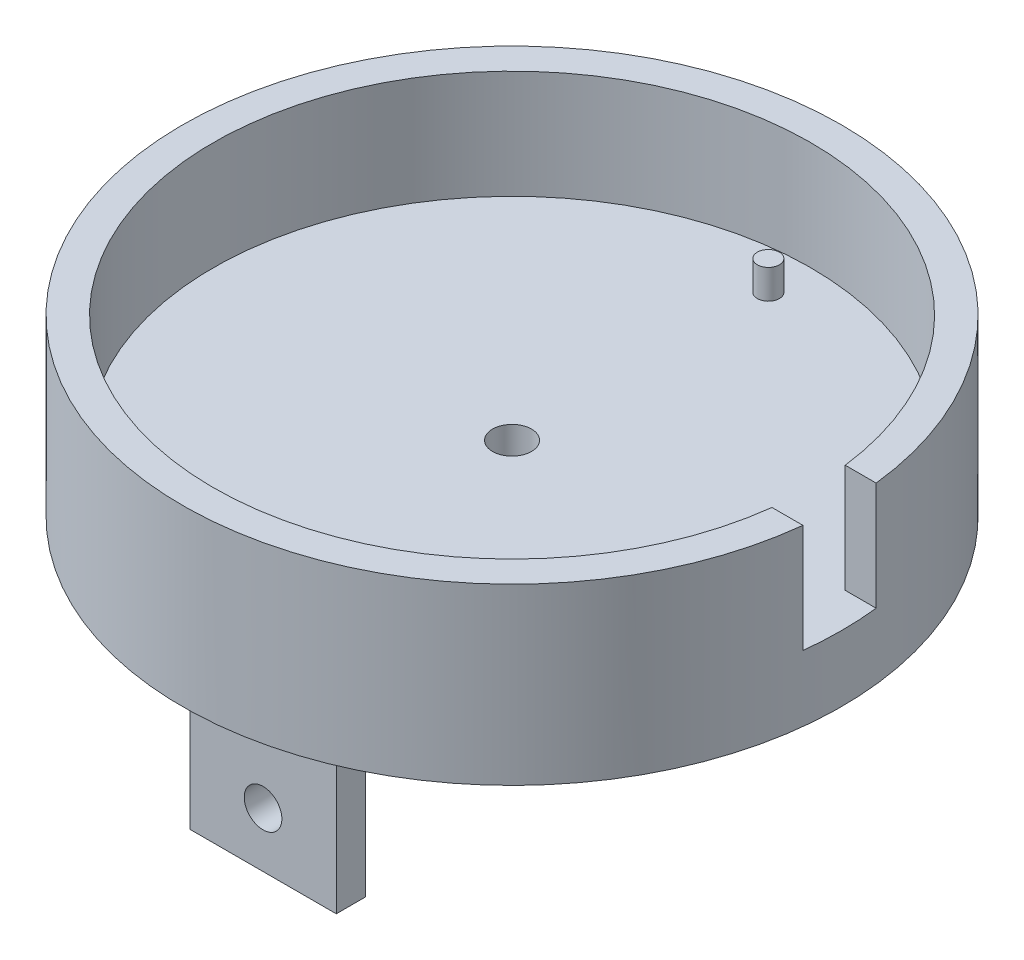
ISO-10303-21;
HEADER;
FILE_DESCRIPTION(('STEP AP214'),'2;1');
FILE_NAME('part.step','',(''),(''),'','','');
FILE_SCHEMA(('AUTOMOTIVE_DESIGN { 1 0 10303 214 1 1 1 1 }'));
ENDSEC;
DATA;
#1=APPLICATION_CONTEXT('core data for automotive mechanical design processes');
#2=APPLICATION_PROTOCOL_DEFINITION('international standard','automotive_design',2000,#1);
#3=PRODUCT_CONTEXT('',#1,'mechanical');
#4=PRODUCT('Part','Part','',(#3));
#5=PRODUCT_RELATED_PRODUCT_CATEGORY('part','',(#4));
#6=PRODUCT_DEFINITION_FORMATION('','',#4);
#7=PRODUCT_DEFINITION_CONTEXT('part definition',#1,'design');
#8=PRODUCT_DEFINITION('design','',#6,#7);
#9=PRODUCT_DEFINITION_SHAPE('','',#8);
#10=(LENGTH_UNIT() NAMED_UNIT(*) SI_UNIT(.MILLI.,.METRE.));
#11=(NAMED_UNIT(*) PLANE_ANGLE_UNIT() SI_UNIT($,.RADIAN.));
#12=(NAMED_UNIT(*) SI_UNIT($,.STERADIAN.) SOLID_ANGLE_UNIT());
#13=UNCERTAINTY_MEASURE_WITH_UNIT(LENGTH_MEASURE(1.E-05),#10,'distance_accuracy_value','');
#14=(GEOMETRIC_REPRESENTATION_CONTEXT(3) GLOBAL_UNCERTAINTY_ASSIGNED_CONTEXT((#13)) GLOBAL_UNIT_ASSIGNED_CONTEXT((#10,
#11,#12)) REPRESENTATION_CONTEXT('',''));
#15=CARTESIAN_POINT('',(0.,0.,0.));
#16=DIRECTION('',(0.,0.,1.));
#17=DIRECTION('',(1.,0.,0.));
#18=AXIS2_PLACEMENT_3D('',#15,#16,#17);
#19=CARTESIAN_POINT('',(0.,0.,0.));
#20=DIRECTION('',(0.,-1.,0.));
#21=DIRECTION('',(0.,0.,-1.));
#22=AXIS2_PLACEMENT_3D('',#19,#20,#21);
#23=PLANE('',#22);
#24=DIRECTION('',(-1.,0.,0.));
#25=VECTOR('',#24,1.);
#26=CARTESIAN_POINT('',(-12.7,0.,38.1));
#27=LINE('',#26,#25);
#28=CARTESIAN_POINT('',(19.05,0.,38.1));
#29=VERTEX_POINT('',#28);
#30=CARTESIAN_POINT('',(-19.05,0.,38.1));
#31=VERTEX_POINT('',#30);
#32=EDGE_CURVE('E184',#29,#31,#27,.T.);
#33=ORIENTED_EDGE('',*,*,#32,.T.);
#34=DIRECTION('',(0.,0.,1.));
#35=VECTOR('',#34,1.);
#36=CARTESIAN_POINT('',(-19.05,0.,43.18));
#37=LINE('',#36,#35);
#38=CARTESIAN_POINT('',(-19.05,0.,49.53));
#39=VERTEX_POINT('',#38);
#40=EDGE_CURVE('E270',#31,#39,#37,.T.);
#41=ORIENTED_EDGE('',*,*,#40,.T.);
#42=DIRECTION('',(1.,0.,0.));
#43=VECTOR('',#42,1.);
#44=CARTESIAN_POINT('',(12.7,0.,49.53));
#45=LINE('',#44,#43);
#46=CARTESIAN_POINT('',(19.05,0.,49.53));
#47=VERTEX_POINT('',#46);
#48=EDGE_CURVE('E263',#39,#47,#45,.T.);
#49=ORIENTED_EDGE('',*,*,#48,.T.);
#50=DIRECTION('',(0.,0.,-1.));
#51=VECTOR('',#50,1.);
#52=CARTESIAN_POINT('',(19.05,0.,38.1));
#53=LINE('',#52,#51);
#54=EDGE_CURVE('E267',#47,#29,#53,.T.);
#55=ORIENTED_EDGE('',*,*,#54,.T.);
#56=EDGE_LOOP('',(#33,#41,#49,#55));
#57=FACE_BOUND('',#56,.T.);
#58=DIRECTION('',(1.,0.,0.));
#59=VECTOR('',#58,1.);
#60=CARTESIAN_POINT('',(-12.7,0.,-38.1));
#61=LINE('',#60,#59);
#62=CARTESIAN_POINT('',(-19.05,0.,-38.1));
#63=VERTEX_POINT('',#62);
#64=CARTESIAN_POINT('',(19.05,0.,-38.1));
#65=VERTEX_POINT('',#64);
#66=EDGE_CURVE('E173',#63,#65,#61,.T.);
#67=ORIENTED_EDGE('',*,*,#66,.T.);
#68=DIRECTION('',(0.,0.,-1.));
#69=VECTOR('',#68,1.);
#70=CARTESIAN_POINT('',(19.05,0.,-43.18));
#71=LINE('',#70,#69);
#72=CARTESIAN_POINT('',(19.05,0.,-49.53));
#73=VERTEX_POINT('',#72);
#74=EDGE_CURVE('E278',#65,#73,#71,.T.);
#75=ORIENTED_EDGE('',*,*,#74,.T.);
#76=DIRECTION('',(-1.,0.,0.));
#77=VECTOR('',#76,1.);
#78=CARTESIAN_POINT('',(-12.7,0.,-49.53));
#79=LINE('',#78,#77);
#80=CARTESIAN_POINT('',(-19.05,0.,-49.53));
#81=VERTEX_POINT('',#80);
#82=EDGE_CURVE('E276',#73,#81,#79,.T.);
#83=ORIENTED_EDGE('',*,*,#82,.T.);
#84=DIRECTION('',(0.,0.,1.));
#85=VECTOR('',#84,1.);
#86=CARTESIAN_POINT('',(-19.05,0.,-38.1));
#87=LINE('',#86,#85);
#88=EDGE_CURVE('E273',#81,#63,#87,.T.);
#89=ORIENTED_EDGE('',*,*,#88,.T.);
#90=EDGE_LOOP('',(#67,#75,#83,#89));
#91=FACE_BOUND('',#90,.T.);
#92=CARTESIAN_POINT('',(0.,0.,0.));
#93=DIRECTION('',(0.,-1.,0.));
#94=DIRECTION('',(0.,0.,-1.));
#95=AXIS2_PLACEMENT_3D('',#92,#93,#94);
#96=CIRCLE('',#95,3.3782);
#97=CARTESIAN_POINT('',(0.,0.,-3.3782));
#98=VERTEX_POINT('',#97);
#99=EDGE_CURVE('E222',#98,#98,#96,.T.);
#100=ORIENTED_EDGE('',*,*,#99,.F.);
#101=EDGE_LOOP('',(#100));
#102=FACE_BOUND('',#101,.T.);
#103=CARTESIAN_POINT('',(0.,0.,0.));
#104=DIRECTION('',(0.,-1.,0.));
#105=DIRECTION('',(0.,0.,-1.));
#106=AXIS2_PLACEMENT_3D('',#103,#104,#105);
#107=CIRCLE('',#106,57.15);
#108=CARTESIAN_POINT('',(0.,0.,-57.15));
#109=VERTEX_POINT('',#108);
#110=EDGE_CURVE('E260',#109,#109,#107,.T.);
#111=ORIENTED_EDGE('',*,*,#110,.T.);
#112=EDGE_LOOP('',(#111));
#113=FACE_BOUND('',#112,.T.);
#114=ADVANCED_FACE('F34',(#57,#91,#102,#113),#23,.T.);
#115=CARTESIAN_POINT('',(0.,0.,0.));
#116=DIRECTION('',(0.,-1.,0.));
#117=DIRECTION('',(0.,0.,-1.));
#118=AXIS2_PLACEMENT_3D('',#115,#116,#117);
#119=CYLINDRICAL_SURFACE('',#118,57.15);
#120=DIRECTION('',(0.,-1.,0.));
#121=VECTOR('',#120,1.);
#122=CARTESIAN_POINT('',(56.7961266284947,0.,-6.35));
#123=LINE('',#122,#121);
#124=CARTESIAN_POINT('',(56.7961266284947,11.43,-6.35));
#125=VERTEX_POINT('',#124);
#126=CARTESIAN_POINT('',(56.7961266284947,30.226,-6.35));
#127=VERTEX_POINT('',#126);
#128=EDGE_CURVE('E247',#125,#127,#123,.F.);
#129=ORIENTED_EDGE('',*,*,#128,.F.);
#130=CARTESIAN_POINT('',(0.,11.43,0.));
#131=DIRECTION('',(0.,-1.,0.));
#132=DIRECTION('',(0.,0.,-1.));
#133=AXIS2_PLACEMENT_3D('',#130,#131,#132);
#134=CIRCLE('',#133,57.15);
#135=CARTESIAN_POINT('',(56.7961266284947,11.43,6.35));
#136=VERTEX_POINT('',#135);
#137=EDGE_CURVE('E249',#136,#125,#134,.F.);
#138=ORIENTED_EDGE('',*,*,#137,.F.);
#139=DIRECTION('',(0.,-1.,0.));
#140=VECTOR('',#139,1.);
#141=CARTESIAN_POINT('',(56.7961266284947,0.,6.35));
#142=LINE('',#141,#140);
#143=CARTESIAN_POINT('',(56.7961266284947,30.226,6.35));
#144=VERTEX_POINT('',#143);
#145=EDGE_CURVE('E240',#144,#136,#142,.T.);
#146=ORIENTED_EDGE('',*,*,#145,.F.);
#147=CARTESIAN_POINT('',(0.,30.226,0.));
#148=DIRECTION('',(0.,-1.,0.));
#149=DIRECTION('',(0.,0.,-1.));
#150=AXIS2_PLACEMENT_3D('',#147,#148,#149);
#151=CIRCLE('',#150,57.15);
#152=EDGE_CURVE('E257',#144,#127,#151,.T.);
#153=ORIENTED_EDGE('',*,*,#152,.T.);
#154=EDGE_LOOP('',(#129,#138,#146,#153));
#155=FACE_BOUND('',#154,.T.);
#156=ORIENTED_EDGE('',*,*,#110,.F.);
#157=EDGE_LOOP('',(#156));
#158=FACE_BOUND('',#157,.T.);
#159=ADVANCED_FACE('F345',(#155,#158),#119,.T.);
#160=CARTESIAN_POINT('',(-57.15,30.226,-3.9907631702977E-13));
#161=DIRECTION('',(0.,1.,0.));
#162=DIRECTION('',(0.,0.,1.));
#163=AXIS2_PLACEMENT_3D('',#160,#161,#162);
#164=PLANE('',#163);
#165=DIRECTION('',(1.,0.,0.));
#166=VECTOR('',#165,1.);
#167=CARTESIAN_POINT('',(-57.151,30.226,-6.35));
#168=LINE('',#167,#166);
#169=CARTESIAN_POINT('',(51.4254349130856,30.226,-6.35));
#170=VERTEX_POINT('',#169);
#171=EDGE_CURVE('E236',#170,#127,#168,.T.);
#172=ORIENTED_EDGE('',*,*,#171,.T.);
#173=ORIENTED_EDGE('',*,*,#152,.F.);
#174=DIRECTION('',(1.,0.,0.));
#175=VECTOR('',#174,1.);
#176=CARTESIAN_POINT('',(-57.151,30.226,6.35));
#177=LINE('',#176,#175);
#178=CARTESIAN_POINT('',(51.4254349130856,30.226,6.35));
#179=VERTEX_POINT('',#178);
#180=EDGE_CURVE('E232',#179,#144,#177,.T.);
#181=ORIENTED_EDGE('',*,*,#180,.F.);
#182=CARTESIAN_POINT('',(0.,30.226,0.));
#183=DIRECTION('',(0.,-1.,0.));
#184=DIRECTION('',(0.,0.,-1.));
#185=AXIS2_PLACEMENT_3D('',#182,#183,#184);
#186=CIRCLE('',#185,51.816);
#187=EDGE_CURVE('E254',#179,#170,#186,.T.);
#188=ORIENTED_EDGE('',*,*,#187,.T.);
#189=EDGE_LOOP('',(#172,#173,#181,#188));
#190=FACE_BOUND('',#189,.T.);
#191=ADVANCED_FACE('F350',(#190),#164,.T.);
#192=CARTESIAN_POINT('',(0.,0.,0.));
#193=DIRECTION('',(0.,-1.,0.));
#194=DIRECTION('',(0.,0.,-1.));
#195=AXIS2_PLACEMENT_3D('',#192,#193,#194);
#196=CYLINDRICAL_SURFACE('',#195,51.816);
#197=DIRECTION('',(0.,-1.,0.));
#198=VECTOR('',#197,1.);
#199=CARTESIAN_POINT('',(51.4254349130856,0.,-6.35));
#200=LINE('',#199,#198);
#201=CARTESIAN_POINT('',(51.4254349130856,11.43,-6.35));
#202=VERTEX_POINT('',#201);
#203=EDGE_CURVE('E233',#202,#170,#200,.F.);
#204=ORIENTED_EDGE('',*,*,#203,.T.);
#205=ORIENTED_EDGE('',*,*,#187,.F.);
#206=DIRECTION('',(0.,-1.,0.));
#207=VECTOR('',#206,1.);
#208=CARTESIAN_POINT('',(51.4254349130856,0.,6.35));
#209=LINE('',#208,#207);
#210=CARTESIAN_POINT('',(51.4254349130856,11.43,6.35));
#211=VERTEX_POINT('',#210);
#212=EDGE_CURVE('E228',#179,#211,#209,.T.);
#213=ORIENTED_EDGE('',*,*,#212,.T.);
#214=CARTESIAN_POINT('',(0.,11.43,0.));
#215=DIRECTION('',(0.,-1.,0.));
#216=DIRECTION('',(0.,0.,-1.));
#217=AXIS2_PLACEMENT_3D('',#214,#215,#216);
#218=CIRCLE('',#217,51.816);
#219=EDGE_CURVE('E251',#211,#202,#218,.T.);
#220=ORIENTED_EDGE('',*,*,#219,.T.);
#221=EDGE_LOOP('',(#204,#205,#213,#220));
#222=FACE_BOUND('',#221,.T.);
#223=ADVANCED_FACE('F468',(#222),#196,.F.);
#224=CARTESIAN_POINT('',(-51.816,11.43,-3.61829194106992E-13));
#225=DIRECTION('',(0.,1.,0.));
#226=DIRECTION('',(0.,0.,1.));
#227=AXIS2_PLACEMENT_3D('',#224,#225,#226);
#228=PLANE('',#227);
#229=CARTESIAN_POINT('',(0.,11.43,44.45));
#230=DIRECTION('',(0.,1.,0.));
#231=DIRECTION('',(0.,0.,-1.));
#232=AXIS2_PLACEMENT_3D('',#229,#230,#231);
#233=CIRCLE('',#232,1.905);
#234=CARTESIAN_POINT('',(0.,11.43,42.545));
#235=VERTEX_POINT('',#234);
#236=EDGE_CURVE('E205',#235,#235,#233,.T.);
#237=ORIENTED_EDGE('',*,*,#236,.F.);
#238=EDGE_LOOP('',(#237));
#239=FACE_BOUND('',#238,.T.);
#240=CARTESIAN_POINT('',(0.,11.43,-44.45));
#241=DIRECTION('',(0.,1.,0.));
#242=DIRECTION('',(0.,0.,1.));
#243=AXIS2_PLACEMENT_3D('',#240,#241,#242);
#244=CIRCLE('',#243,1.905);
#245=CARTESIAN_POINT('',(0.,11.43,-42.545));
#246=VERTEX_POINT('',#245);
#247=EDGE_CURVE('E216',#246,#246,#244,.T.);
#248=ORIENTED_EDGE('',*,*,#247,.F.);
#249=EDGE_LOOP('',(#248));
#250=FACE_BOUND('',#249,.T.);
#251=CARTESIAN_POINT('',(0.,11.43,0.));
#252=DIRECTION('',(0.,1.,0.));
#253=DIRECTION('',(0.,0.,1.));
#254=AXIS2_PLACEMENT_3D('',#251,#252,#253);
#255=CIRCLE('',#254,3.3782);
#256=CARTESIAN_POINT('',(0.,11.43,3.3782));
#257=VERTEX_POINT('',#256);
#258=EDGE_CURVE('E227',#257,#257,#255,.T.);
#259=ORIENTED_EDGE('',*,*,#258,.F.);
#260=EDGE_LOOP('',(#259));
#261=FACE_BOUND('',#260,.T.);
#262=ORIENTED_EDGE('',*,*,#219,.F.);
#263=DIRECTION('',(1.,0.,0.));
#264=VECTOR('',#263,1.);
#265=CARTESIAN_POINT('',(-57.151,11.43,6.35));
#266=LINE('',#265,#264);
#267=EDGE_CURVE('E231',#211,#136,#266,.T.);
#268=ORIENTED_EDGE('',*,*,#267,.T.);
#269=ORIENTED_EDGE('',*,*,#137,.T.);
#270=DIRECTION('',(1.,0.,0.));
#271=VECTOR('',#270,1.);
#272=CARTESIAN_POINT('',(-57.151,11.43,-6.35));
#273=LINE('',#272,#271);
#274=EDGE_CURVE('E237',#202,#125,#273,.T.);
#275=ORIENTED_EDGE('',*,*,#274,.F.);
#276=EDGE_LOOP('',(#262,#268,#269,#275));
#277=FACE_BOUND('',#276,.T.);
#278=ADVANCED_FACE('F476',(#239,#250,#261,#277),#228,.T.);
#279=CARTESIAN_POINT('',(-57.151,11.43,-6.35));
#280=DIRECTION('',(0.,0.,-1.));
#281=DIRECTION('',(0.,1.,0.));
#282=AXIS2_PLACEMENT_3D('',#279,#280,#281);
#283=PLANE('',#282);
#284=ORIENTED_EDGE('',*,*,#128,.T.);
#285=ORIENTED_EDGE('',*,*,#171,.F.);
#286=ORIENTED_EDGE('',*,*,#203,.F.);
#287=ORIENTED_EDGE('',*,*,#274,.T.);
#288=EDGE_LOOP('',(#284,#285,#286,#287));
#289=FACE_BOUND('',#288,.T.);
#290=ADVANCED_FACE('F485',(#289),#283,.F.);
#291=CARTESIAN_POINT('',(-57.151,11.43,6.35));
#292=DIRECTION('',(0.,0.,1.));
#293=DIRECTION('',(0.,-1.,0.));
#294=AXIS2_PLACEMENT_3D('',#291,#292,#293);
#295=PLANE('',#294);
#296=ORIENTED_EDGE('',*,*,#145,.T.);
#297=ORIENTED_EDGE('',*,*,#267,.F.);
#298=ORIENTED_EDGE('',*,*,#212,.F.);
#299=ORIENTED_EDGE('',*,*,#180,.T.);
#300=EDGE_LOOP('',(#296,#297,#298,#299));
#301=FACE_BOUND('',#300,.T.);
#302=ADVANCED_FACE('F499',(#301),#295,.F.);
#303=CARTESIAN_POINT('',(0.,30.226,0.));
#304=DIRECTION('',(0.,-1.,0.));
#305=DIRECTION('',(0.,0.,-1.));
#306=AXIS2_PLACEMENT_3D('',#303,#304,#305);
#307=CYLINDRICAL_SURFACE('',#306,3.3782);
#308=ORIENTED_EDGE('',*,*,#258,.T.);
#309=EDGE_LOOP('',(#308));
#310=FACE_BOUND('',#309,.T.);
#311=ORIENTED_EDGE('',*,*,#99,.T.);
#312=EDGE_LOOP('',(#311));
#313=FACE_BOUND('',#312,.T.);
#314=ADVANCED_FACE('F508',(#310,#313),#307,.F.);
#315=CARTESIAN_POINT('',(0.,16.51,-44.45));
#316=DIRECTION('',(0.,-1.,0.));
#317=DIRECTION('',(0.,0.,-1.));
#318=AXIS2_PLACEMENT_3D('',#315,#316,#317);
#319=CYLINDRICAL_SURFACE('',#318,1.905);
#320=CARTESIAN_POINT('',(0.,16.51,-44.45));
#321=DIRECTION('',(0.,1.,0.));
#322=DIRECTION('',(0.,0.,1.));
#323=AXIS2_PLACEMENT_3D('',#320,#321,#322);
#324=CIRCLE('',#323,1.905);
#325=CARTESIAN_POINT('',(0.,16.51,-42.545));
#326=VERTEX_POINT('',#325);
#327=EDGE_CURVE('E219',#326,#326,#324,.T.);
#328=ORIENTED_EDGE('',*,*,#327,.F.);
#329=EDGE_LOOP('',(#328));
#330=FACE_BOUND('',#329,.T.);
#331=ORIENTED_EDGE('',*,*,#247,.T.);
#332=EDGE_LOOP('',(#331));
#333=FACE_BOUND('',#332,.T.);
#334=ADVANCED_FACE('F516',(#330,#333),#319,.T.);
#335=CARTESIAN_POINT('',(0.,16.51,-44.45));
#336=DIRECTION('',(0.,1.,0.));
#337=DIRECTION('',(0.,0.,1.));
#338=AXIS2_PLACEMENT_3D('',#335,#336,#337);
#339=PLANE('',#338);
#340=ORIENTED_EDGE('',*,*,#327,.T.);
#341=EDGE_LOOP('',(#340));
#342=FACE_BOUND('',#341,.T.);
#343=ADVANCED_FACE('F524',(#342),#339,.T.);
#344=CARTESIAN_POINT('',(0.,16.51,44.45));
#345=DIRECTION('',(0.,-1.,0.));
#346=DIRECTION('',(0.,0.,-1.));
#347=AXIS2_PLACEMENT_3D('',#344,#345,#346);
#348=CYLINDRICAL_SURFACE('',#347,1.905);
#349=CARTESIAN_POINT('',(0.,16.51,44.45));
#350=DIRECTION('',(0.,1.,0.));
#351=DIRECTION('',(0.,0.,-1.));
#352=AXIS2_PLACEMENT_3D('',#349,#350,#351);
#353=CIRCLE('',#352,1.905);
#354=CARTESIAN_POINT('',(0.,16.51,42.545));
#355=VERTEX_POINT('',#354);
#356=EDGE_CURVE('E213',#355,#355,#353,.T.);
#357=ORIENTED_EDGE('',*,*,#356,.F.);
#358=EDGE_LOOP('',(#357));
#359=FACE_BOUND('',#358,.T.);
#360=ORIENTED_EDGE('',*,*,#236,.T.);
#361=EDGE_LOOP('',(#360));
#362=FACE_BOUND('',#361,.T.);
#363=ADVANCED_FACE('F533',(#359,#362),#348,.T.);
#364=CARTESIAN_POINT('',(0.,16.51,44.45));
#365=DIRECTION('',(0.,-1.,0.));
#366=DIRECTION('',(0.,0.,-1.));
#367=AXIS2_PLACEMENT_3D('',#364,#365,#366);
#368=PLANE('',#367);
#369=ORIENTED_EDGE('',*,*,#356,.T.);
#370=EDGE_LOOP('',(#369));
#371=FACE_BOUND('',#370,.T.);
#372=ADVANCED_FACE('F340',(#371),#368,.F.);
#373=CARTESIAN_POINT('',(12.7,-31.75,38.1));
#374=DIRECTION('',(1.,0.,0.));
#375=DIRECTION('',(0.,0.,-1.));
#376=AXIS2_PLACEMENT_3D('',#373,#374,#375);
#377=PLANE('',#376);
#378=DIRECTION('',(0.,1.,0.));
#379=VECTOR('',#378,1.);
#380=CARTESIAN_POINT('',(12.7,-31.75,38.1));
#381=LINE('',#380,#379);
#382=CARTESIAN_POINT('',(12.7,-31.75,38.1));
#383=VERTEX_POINT('',#382);
#384=CARTESIAN_POINT('',(12.7,-6.35,38.1));
#385=VERTEX_POINT('',#384);
#386=EDGE_CURVE('E201',#383,#385,#381,.T.);
#387=ORIENTED_EDGE('',*,*,#386,.T.);
#388=DIRECTION('',(0.,0.,-1.));
#389=VECTOR('',#388,1.);
#390=CARTESIAN_POINT('',(12.7,-6.35,43.18));
#391=LINE('',#390,#389);
#392=CARTESIAN_POINT('',(12.7,-6.35,43.18));
#393=VERTEX_POINT('',#392);
#394=EDGE_CURVE('E56',#385,#393,#391,.F.);
#395=ORIENTED_EDGE('',*,*,#394,.T.);
#396=DIRECTION('',(0.,1.,0.));
#397=VECTOR('',#396,1.);
#398=CARTESIAN_POINT('',(12.7,-31.75,43.18));
#399=LINE('',#398,#397);
#400=CARTESIAN_POINT('',(12.7,-31.75,43.18));
#401=VERTEX_POINT('',#400);
#402=EDGE_CURVE('E203',#401,#393,#399,.T.);
#403=ORIENTED_EDGE('',*,*,#402,.F.);
#404=DIRECTION('',(0.,0.,-1.));
#405=VECTOR('',#404,1.);
#406=CARTESIAN_POINT('',(12.7,-31.75,38.1));
#407=LINE('',#406,#405);
#408=EDGE_CURVE('E189',#401,#383,#407,.T.);
#409=ORIENTED_EDGE('',*,*,#408,.T.);
#410=EDGE_LOOP('',(#387,#395,#403,#409));
#411=FACE_BOUND('',#410,.T.);
#412=ADVANCED_FACE('F329',(#411),#377,.T.);
#413=CARTESIAN_POINT('',(-12.7,-31.75,43.18));
#414=DIRECTION('',(0.,0.,1.));
#415=DIRECTION('',(1.,0.,0.));
#416=AXIS2_PLACEMENT_3D('',#413,#414,#415);
#417=PLANE('',#416);
#418=CARTESIAN_POINT('',(0.,-22.225,43.18));
#419=DIRECTION('',(0.,0.,1.));
#420=DIRECTION('',(1.,0.,0.));
#421=AXIS2_PLACEMENT_3D('',#418,#419,#420);
#422=CIRCLE('',#421,3.2639);
#423=CARTESIAN_POINT('',(3.2639,-22.225,43.18));
#424=VERTEX_POINT('',#423);
#425=EDGE_CURVE('E178',#424,#424,#422,.T.);
#426=ORIENTED_EDGE('',*,*,#425,.F.);
#427=EDGE_LOOP('',(#426));
#428=FACE_BOUND('',#427,.T.);
#429=ORIENTED_EDGE('',*,*,#402,.T.);
#430=DIRECTION('',(1.,0.,0.));
#431=VECTOR('',#430,1.);
#432=CARTESIAN_POINT('',(-12.7,-6.35,43.18));
#433=LINE('',#432,#431);
#434=CARTESIAN_POINT('',(-12.7,-6.35,43.18));
#435=VERTEX_POINT('',#434);
#436=EDGE_CURVE('E290',#393,#435,#433,.F.);
#437=ORIENTED_EDGE('',*,*,#436,.T.);
#438=DIRECTION('',(0.,1.,0.));
#439=VECTOR('',#438,1.);
#440=CARTESIAN_POINT('',(-12.7,-31.75,43.18));
#441=LINE('',#440,#439);
#442=CARTESIAN_POINT('',(-12.7,-31.75,43.18));
#443=VERTEX_POINT('',#442);
#444=EDGE_CURVE('E206',#443,#435,#441,.T.);
#445=ORIENTED_EDGE('',*,*,#444,.F.);
#446=DIRECTION('',(1.,0.,0.));
#447=VECTOR('',#446,1.);
#448=CARTESIAN_POINT('',(-12.7,-31.75,43.18));
#449=LINE('',#448,#447);
#450=EDGE_CURVE('E198',#443,#401,#449,.T.);
#451=ORIENTED_EDGE('',*,*,#450,.T.);
#452=EDGE_LOOP('',(#429,#437,#445,#451));
#453=FACE_BOUND('',#452,.T.);
#454=ADVANCED_FACE('F331',(#428,#453),#417,.T.);
#455=CARTESIAN_POINT('',(-12.7,-31.75,38.1));
#456=DIRECTION('',(-1.,0.,0.));
#457=DIRECTION('',(0.,0.,1.));
#458=AXIS2_PLACEMENT_3D('',#455,#456,#457);
#459=PLANE('',#458);
#460=ORIENTED_EDGE('',*,*,#444,.T.);
#461=DIRECTION('',(0.,0.,1.));
#462=VECTOR('',#461,1.);
#463=CARTESIAN_POINT('',(-12.7,-6.35,38.1));
#464=LINE('',#463,#462);
#465=CARTESIAN_POINT('',(-12.7,-6.35,38.1));
#466=VERTEX_POINT('',#465);
#467=EDGE_CURVE('E287',#435,#466,#464,.F.);
#468=ORIENTED_EDGE('',*,*,#467,.T.);
#469=DIRECTION('',(0.,1.,0.));
#470=VECTOR('',#469,1.);
#471=CARTESIAN_POINT('',(-12.7,-31.75,38.1));
#472=LINE('',#471,#470);
#473=CARTESIAN_POINT('',(-12.7,-31.75,38.1));
#474=VERTEX_POINT('',#473);
#475=EDGE_CURVE('E209',#474,#466,#472,.T.);
#476=ORIENTED_EDGE('',*,*,#475,.F.);
#477=DIRECTION('',(0.,0.,1.));
#478=VECTOR('',#477,1.);
#479=CARTESIAN_POINT('',(-12.7,-31.75,38.1));
#480=LINE('',#479,#478);
#481=EDGE_CURVE('E195',#474,#443,#480,.T.);
#482=ORIENTED_EDGE('',*,*,#481,.T.);
#483=EDGE_LOOP('',(#460,#468,#476,#482));
#484=FACE_BOUND('',#483,.T.);
#485=ADVANCED_FACE('F321',(#484),#459,.T.);
#486=CARTESIAN_POINT('',(-12.7,-31.75,38.1));
#487=DIRECTION('',(0.,0.,-1.));
#488=DIRECTION('',(-1.,0.,0.));
#489=AXIS2_PLACEMENT_3D('',#486,#487,#488);
#490=PLANE('',#489);
#491=CARTESIAN_POINT('',(0.,-22.225,38.1));
#492=DIRECTION('',(0.,0.,-1.));
#493=DIRECTION('',(-1.,0.,0.));
#494=AXIS2_PLACEMENT_3D('',#491,#492,#493);
#495=CIRCLE('',#494,3.2639);
#496=CARTESIAN_POINT('',(-3.2639,-22.225,38.1));
#497=VERTEX_POINT('',#496);
#498=EDGE_CURVE('E640',#497,#497,#495,.T.);
#499=ORIENTED_EDGE('',*,*,#498,.F.);
#500=EDGE_LOOP('',(#499));
#501=FACE_BOUND('',#500,.T.);
#502=ORIENTED_EDGE('',*,*,#32,.F.);
#503=CARTESIAN_POINT('',(19.05,-6.35,38.1));
#504=DIRECTION('',(0.,0.,-1.));
#505=DIRECTION('',(-1.,0.,0.));
#506=AXIS2_PLACEMENT_3D('',#503,#504,#505);
#507=CIRCLE('',#506,6.35);
#508=EDGE_CURVE('E11',#29,#385,#507,.F.);
#509=ORIENTED_EDGE('',*,*,#508,.T.);
#510=ORIENTED_EDGE('',*,*,#386,.F.);
#511=DIRECTION('',(-1.,0.,0.));
#512=VECTOR('',#511,1.);
#513=CARTESIAN_POINT('',(-12.7,-31.75,38.1));
#514=LINE('',#513,#512);
#515=EDGE_CURVE('E192',#383,#474,#514,.T.);
#516=ORIENTED_EDGE('',*,*,#515,.T.);
#517=ORIENTED_EDGE('',*,*,#475,.T.);
#518=CARTESIAN_POINT('',(-19.05,-6.35,38.1));
#519=DIRECTION('',(0.,0.,-1.));
#520=DIRECTION('',(-1.,0.,0.));
#521=AXIS2_PLACEMENT_3D('',#518,#519,#520);
#522=CIRCLE('',#521,6.35);
#523=EDGE_CURVE('E43',#466,#31,#522,.F.);
#524=ORIENTED_EDGE('',*,*,#523,.T.);
#525=EDGE_LOOP('',(#502,#509,#510,#516,#517,#524));
#526=FACE_BOUND('',#525,.T.);
#527=ADVANCED_FACE('F323',(#501,#526),#490,.T.);
#528=CARTESIAN_POINT('',(0.,-31.75,0.));
#529=DIRECTION('',(0.,1.,0.));
#530=DIRECTION('',(0.,0.,1.));
#531=AXIS2_PLACEMENT_3D('',#528,#529,#530);
#532=PLANE('',#531);
#533=ORIENTED_EDGE('',*,*,#408,.F.);
#534=ORIENTED_EDGE('',*,*,#450,.F.);
#535=ORIENTED_EDGE('',*,*,#481,.F.);
#536=ORIENTED_EDGE('',*,*,#515,.F.);
#537=EDGE_LOOP('',(#533,#534,#535,#536));
#538=FACE_BOUND('',#537,.T.);
#539=ADVANCED_FACE('F327',(#538),#532,.F.);
#540=CARTESIAN_POINT('',(-12.7,-31.75,-38.1));
#541=DIRECTION('',(-1.,0.,0.));
#542=DIRECTION('',(0.,0.,1.));
#543=AXIS2_PLACEMENT_3D('',#540,#541,#542);
#544=PLANE('',#543);
#545=DIRECTION('',(0.,1.,0.));
#546=VECTOR('',#545,1.);
#547=CARTESIAN_POINT('',(-12.7,-31.75,-38.1));
#548=LINE('',#547,#546);
#549=CARTESIAN_POINT('',(-12.7,-31.75,-38.1));
#550=VERTEX_POINT('',#549);
#551=CARTESIAN_POINT('',(-12.7,-6.35,-38.1));
#552=VERTEX_POINT('',#551);
#553=EDGE_CURVE('E147',#550,#552,#548,.T.);
#554=ORIENTED_EDGE('',*,*,#553,.T.);
#555=DIRECTION('',(0.,0.,1.));
#556=VECTOR('',#555,1.);
#557=CARTESIAN_POINT('',(-12.7,-6.35,-43.18));
#558=LINE('',#557,#556);
#559=CARTESIAN_POINT('',(-12.7,-6.35,-43.18));
#560=VERTEX_POINT('',#559);
#561=EDGE_CURVE('E285',#552,#560,#558,.F.);
#562=ORIENTED_EDGE('',*,*,#561,.T.);
#563=DIRECTION('',(0.,1.,0.));
#564=VECTOR('',#563,1.);
#565=CARTESIAN_POINT('',(-12.7,-31.75,-43.18));
#566=LINE('',#565,#564);
#567=CARTESIAN_POINT('',(-12.7,-31.75,-43.18));
#568=VERTEX_POINT('',#567);
#569=EDGE_CURVE('E172',#568,#560,#566,.T.);
#570=ORIENTED_EDGE('',*,*,#569,.F.);
#571=DIRECTION('',(0.,0.,1.));
#572=VECTOR('',#571,1.);
#573=CARTESIAN_POINT('',(-12.7,-31.75,-38.1));
#574=LINE('',#573,#572);
#575=EDGE_CURVE('E165',#568,#550,#574,.T.);
#576=ORIENTED_EDGE('',*,*,#575,.T.);
#577=EDGE_LOOP('',(#554,#562,#570,#576));
#578=FACE_BOUND('',#577,.T.);
#579=ADVANCED_FACE('F170',(#578),#544,.T.);
#580=CARTESIAN_POINT('',(-12.7,-31.75,-43.18));
#581=DIRECTION('',(0.,0.,-1.));
#582=DIRECTION('',(-1.,0.,0.));
#583=AXIS2_PLACEMENT_3D('',#580,#581,#582);
#584=PLANE('',#583);
#585=CARTESIAN_POINT('',(0.,-22.225,-43.18));
#586=DIRECTION('',(0.,0.,-1.));
#587=DIRECTION('',(-1.,0.,0.));
#588=AXIS2_PLACEMENT_3D('',#585,#586,#587);
#589=CIRCLE('',#588,3.2639);
#590=CARTESIAN_POINT('',(-3.2639,-22.225,-43.18));
#591=VERTEX_POINT('',#590);
#592=EDGE_CURVE('E641',#591,#591,#589,.T.);
#593=ORIENTED_EDGE('',*,*,#592,.F.);
#594=EDGE_LOOP('',(#593));
#595=FACE_BOUND('',#594,.T.);
#596=ORIENTED_EDGE('',*,*,#569,.T.);
#597=DIRECTION('',(-1.,0.,0.));
#598=VECTOR('',#597,1.);
#599=CARTESIAN_POINT('',(12.7,-6.35,-43.18));
#600=LINE('',#599,#598);
#601=CARTESIAN_POINT('',(12.7,-6.35,-43.18));
#602=VERTEX_POINT('',#601);
#603=EDGE_CURVE('E283',#560,#602,#600,.F.);
#604=ORIENTED_EDGE('',*,*,#603,.T.);
#605=DIRECTION('',(0.,1.,0.));
#606=VECTOR('',#605,1.);
#607=CARTESIAN_POINT('',(12.7,-31.75,-43.18));
#608=LINE('',#607,#606);
#609=CARTESIAN_POINT('',(12.7,-31.75,-43.18));
#610=VERTEX_POINT('',#609);
#611=EDGE_CURVE('E185',#610,#602,#608,.T.);
#612=ORIENTED_EDGE('',*,*,#611,.F.);
#613=DIRECTION('',(-1.,0.,0.));
#614=VECTOR('',#613,1.);
#615=CARTESIAN_POINT('',(-12.7,-31.75,-43.18));
#616=LINE('',#615,#614);
#617=EDGE_CURVE('E158',#610,#568,#616,.T.);
#618=ORIENTED_EDGE('',*,*,#617,.T.);
#619=EDGE_LOOP('',(#596,#604,#612,#618));
#620=FACE_BOUND('',#619,.T.);
#621=ADVANCED_FACE('F410',(#595,#620),#584,.T.);
#622=CARTESIAN_POINT('',(12.7,-31.75,-38.1));
#623=DIRECTION('',(1.,0.,0.));
#624=DIRECTION('',(0.,0.,-1.));
#625=AXIS2_PLACEMENT_3D('',#622,#623,#624);
#626=PLANE('',#625);
#627=ORIENTED_EDGE('',*,*,#611,.T.);
#628=DIRECTION('',(0.,0.,-1.));
#629=VECTOR('',#628,1.);
#630=CARTESIAN_POINT('',(12.7,-6.35,-38.1));
#631=LINE('',#630,#629);
#632=CARTESIAN_POINT('',(12.7,-6.35,-38.1));
#633=VERTEX_POINT('',#632);
#634=EDGE_CURVE('E281',#602,#633,#631,.F.);
#635=ORIENTED_EDGE('',*,*,#634,.T.);
#636=DIRECTION('',(0.,1.,0.));
#637=VECTOR('',#636,1.);
#638=CARTESIAN_POINT('',(12.7,-31.75,-38.1));
#639=LINE('',#638,#637);
#640=CARTESIAN_POINT('',(12.7,-31.75,-38.1));
#641=VERTEX_POINT('',#640);
#642=EDGE_CURVE('E157',#641,#633,#639,.T.);
#643=ORIENTED_EDGE('',*,*,#642,.F.);
#644=DIRECTION('',(0.,0.,-1.));
#645=VECTOR('',#644,1.);
#646=CARTESIAN_POINT('',(12.7,-31.75,-38.1));
#647=LINE('',#646,#645);
#648=EDGE_CURVE('E168',#641,#610,#647,.T.);
#649=ORIENTED_EDGE('',*,*,#648,.T.);
#650=EDGE_LOOP('',(#627,#635,#643,#649));
#651=FACE_BOUND('',#650,.T.);
#652=ADVANCED_FACE('F401',(#651),#626,.T.);
#653=CARTESIAN_POINT('',(-12.7,-31.75,-38.1));
#654=DIRECTION('',(0.,0.,1.));
#655=DIRECTION('',(1.,0.,0.));
#656=AXIS2_PLACEMENT_3D('',#653,#654,#655);
#657=PLANE('',#656);
#658=CARTESIAN_POINT('',(0.,-22.225,-38.1));
#659=DIRECTION('',(0.,0.,1.));
#660=DIRECTION('',(1.,0.,0.));
#661=AXIS2_PLACEMENT_3D('',#658,#659,#660);
#662=CIRCLE('',#661,3.2639);
#663=CARTESIAN_POINT('',(3.2639,-22.225,-38.1));
#664=VERTEX_POINT('',#663);
#665=EDGE_CURVE('E38',#664,#664,#662,.T.);
#666=ORIENTED_EDGE('',*,*,#665,.F.);
#667=EDGE_LOOP('',(#666));
#668=FACE_BOUND('',#667,.T.);
#669=ORIENTED_EDGE('',*,*,#66,.F.);
#670=CARTESIAN_POINT('',(-19.05,-6.35,-38.1));
#671=DIRECTION('',(0.,0.,1.));
#672=DIRECTION('',(1.,0.,0.));
#673=AXIS2_PLACEMENT_3D('',#670,#671,#672);
#674=CIRCLE('',#673,6.35);
#675=EDGE_CURVE('E153',#63,#552,#674,.F.);
#676=ORIENTED_EDGE('',*,*,#675,.T.);
#677=ORIENTED_EDGE('',*,*,#553,.F.);
#678=DIRECTION('',(1.,0.,0.));
#679=VECTOR('',#678,1.);
#680=CARTESIAN_POINT('',(-12.7,-31.75,-38.1));
#681=LINE('',#680,#679);
#682=EDGE_CURVE('E151',#550,#641,#681,.T.);
#683=ORIENTED_EDGE('',*,*,#682,.T.);
#684=ORIENTED_EDGE('',*,*,#642,.T.);
#685=CARTESIAN_POINT('',(19.05,-6.35,-38.1));
#686=DIRECTION('',(0.,0.,1.));
#687=DIRECTION('',(1.,0.,0.));
#688=AXIS2_PLACEMENT_3D('',#685,#686,#687);
#689=CIRCLE('',#688,6.35);
#690=EDGE_CURVE('E292',#633,#65,#689,.F.);
#691=ORIENTED_EDGE('',*,*,#690,.T.);
#692=EDGE_LOOP('',(#669,#676,#677,#683,#684,#691));
#693=FACE_BOUND('',#692,.T.);
#694=ADVANCED_FACE('F149',(#668,#693),#657,.T.);
#695=CARTESIAN_POINT('',(0.,-31.75,0.));
#696=DIRECTION('',(0.,-1.,0.));
#697=DIRECTION('',(0.,0.,-1.));
#698=AXIS2_PLACEMENT_3D('',#695,#696,#697);
#699=PLANE('',#698);
#700=ORIENTED_EDGE('',*,*,#575,.F.);
#701=ORIENTED_EDGE('',*,*,#617,.F.);
#702=ORIENTED_EDGE('',*,*,#648,.F.);
#703=ORIENTED_EDGE('',*,*,#682,.F.);
#704=EDGE_LOOP('',(#700,#701,#702,#703));
#705=FACE_BOUND('',#704,.T.);
#706=ADVANCED_FACE('F163',(#705),#699,.T.);
#707=CARTESIAN_POINT('',(-19.05,-6.35,0.));
#708=DIRECTION('',(0.,0.,-1.));
#709=DIRECTION('',(-1.,0.,0.));
#710=AXIS2_PLACEMENT_3D('',#707,#708,#709);
#711=CYLINDRICAL_SURFACE('',#710,6.35);
#712=ORIENTED_EDGE('',*,*,#675,.F.);
#713=ORIENTED_EDGE('',*,*,#88,.F.);
#714=CARTESIAN_POINT('',(-19.05,-6.35,-49.53));
#715=DIRECTION('',(0.707106781186547,0.,-0.707106781186547));
#716=DIRECTION('',(-0.707106781186547,0.,-0.707106781186547));
#717=AXIS2_PLACEMENT_3D('',#714,#715,#716);
#718=ELLIPSE('',#717,8.98025612106915,6.35);
#719=EDGE_CURVE('E175',#560,#81,#718,.F.);
#720=ORIENTED_EDGE('',*,*,#719,.F.);
#721=ORIENTED_EDGE('',*,*,#561,.F.);
#722=EDGE_LOOP('',(#712,#713,#720,#721));
#723=FACE_BOUND('',#722,.T.);
#724=ADVANCED_FACE('F362',(#723),#711,.F.);
#725=CARTESIAN_POINT('',(0.,-6.35,-49.53));
#726=DIRECTION('',(1.,0.,0.));
#727=DIRECTION('',(0.,0.,-1.));
#728=AXIS2_PLACEMENT_3D('',#725,#726,#727);
#729=CYLINDRICAL_SURFACE('',#728,6.35);
#730=ORIENTED_EDGE('',*,*,#719,.T.);
#731=ORIENTED_EDGE('',*,*,#82,.F.);
#732=CARTESIAN_POINT('',(19.05,-6.35,-49.53));
#733=DIRECTION('',(0.707106781186548,0.,0.707106781186547));
#734=DIRECTION('',(0.707106781186547,0.,-0.707106781186548));
#735=AXIS2_PLACEMENT_3D('',#732,#733,#734);
#736=ELLIPSE('',#735,8.98025612106915,6.35);
#737=EDGE_CURVE('E298',#602,#73,#736,.F.);
#738=ORIENTED_EDGE('',*,*,#737,.F.);
#739=ORIENTED_EDGE('',*,*,#603,.F.);
#740=EDGE_LOOP('',(#730,#731,#738,#739));
#741=FACE_BOUND('',#740,.T.);
#742=ADVANCED_FACE('F358',(#741),#729,.F.);
#743=CARTESIAN_POINT('',(19.05,-6.35,0.));
#744=DIRECTION('',(0.,0.,1.));
#745=DIRECTION('',(1.,0.,0.));
#746=AXIS2_PLACEMENT_3D('',#743,#744,#745);
#747=CYLINDRICAL_SURFACE('',#746,6.35);
#748=ORIENTED_EDGE('',*,*,#690,.F.);
#749=ORIENTED_EDGE('',*,*,#634,.F.);
#750=ORIENTED_EDGE('',*,*,#737,.T.);
#751=ORIENTED_EDGE('',*,*,#74,.F.);
#752=EDGE_LOOP('',(#748,#749,#750,#751));
#753=FACE_BOUND('',#752,.T.);
#754=ADVANCED_FACE('F355',(#753),#747,.F.);
#755=CARTESIAN_POINT('',(19.05,-6.35,0.));
#756=DIRECTION('',(0.,0.,1.));
#757=DIRECTION('',(1.,0.,0.));
#758=AXIS2_PLACEMENT_3D('',#755,#756,#757);
#759=CYLINDRICAL_SURFACE('',#758,6.35);
#760=ORIENTED_EDGE('',*,*,#508,.F.);
#761=ORIENTED_EDGE('',*,*,#54,.F.);
#762=CARTESIAN_POINT('',(19.05,-6.35,49.53));
#763=DIRECTION('',(-0.707106781186547,0.,0.707106781186547));
#764=DIRECTION('',(-0.707106781186547,0.,-0.707106781186547));
#765=AXIS2_PLACEMENT_3D('',#762,#763,#764);
#766=ELLIPSE('',#765,8.98025612106915,6.35);
#767=EDGE_CURVE('E300',#393,#47,#766,.F.);
#768=ORIENTED_EDGE('',*,*,#767,.F.);
#769=ORIENTED_EDGE('',*,*,#394,.F.);
#770=EDGE_LOOP('',(#760,#761,#768,#769));
#771=FACE_BOUND('',#770,.T.);
#772=ADVANCED_FACE('F36',(#771),#759,.F.);
#773=CARTESIAN_POINT('',(0.,-6.35,49.53));
#774=DIRECTION('',(-1.,0.,0.));
#775=DIRECTION('',(0.,0.,1.));
#776=AXIS2_PLACEMENT_3D('',#773,#774,#775);
#777=CYLINDRICAL_SURFACE('',#776,6.35);
#778=ORIENTED_EDGE('',*,*,#767,.T.);
#779=ORIENTED_EDGE('',*,*,#48,.F.);
#780=CARTESIAN_POINT('',(-19.05,-6.35,49.53));
#781=DIRECTION('',(-0.707106781186548,0.,-0.707106781186547));
#782=DIRECTION('',(-0.707106781186547,0.,0.707106781186548));
#783=AXIS2_PLACEMENT_3D('',#780,#781,#782);
#784=ELLIPSE('',#783,8.98025612106915,6.35);
#785=EDGE_CURVE('E303',#435,#39,#784,.F.);
#786=ORIENTED_EDGE('',*,*,#785,.F.);
#787=ORIENTED_EDGE('',*,*,#436,.F.);
#788=EDGE_LOOP('',(#778,#779,#786,#787));
#789=FACE_BOUND('',#788,.T.);
#790=ADVANCED_FACE('F309',(#789),#777,.F.);
#791=CARTESIAN_POINT('',(-19.05,-6.35,0.));
#792=DIRECTION('',(0.,0.,-1.));
#793=DIRECTION('',(-1.,0.,0.));
#794=AXIS2_PLACEMENT_3D('',#791,#792,#793);
#795=CYLINDRICAL_SURFACE('',#794,6.35);
#796=ORIENTED_EDGE('',*,*,#523,.F.);
#797=ORIENTED_EDGE('',*,*,#467,.F.);
#798=ORIENTED_EDGE('',*,*,#785,.T.);
#799=ORIENTED_EDGE('',*,*,#40,.F.);
#800=EDGE_LOOP('',(#796,#797,#798,#799));
#801=FACE_BOUND('',#800,.T.);
#802=ADVANCED_FACE('F318',(#801),#795,.F.);
#803=CARTESIAN_POINT('',(0.,-22.225,-57.15));
#804=DIRECTION('',(0.,0.,1.));
#805=DIRECTION('',(1.,0.,0.));
#806=AXIS2_PLACEMENT_3D('',#803,#804,#805);
#807=CYLINDRICAL_SURFACE('',#806,3.2639);
#808=ORIENTED_EDGE('',*,*,#592,.T.);
#809=EDGE_LOOP('',(#808));
#810=FACE_BOUND('',#809,.T.);
#811=ORIENTED_EDGE('',*,*,#665,.T.);
#812=EDGE_LOOP('',(#811));
#813=FACE_BOUND('',#812,.T.);
#814=ADVANCED_FACE('F368',(#810,#813),#807,.F.);
#815=ORIENTED_EDGE('',*,*,#425,.T.);
#816=EDGE_LOOP('',(#815));
#817=FACE_BOUND('',#816,.T.);
#818=ORIENTED_EDGE('',*,*,#498,.T.);
#819=EDGE_LOOP('',(#818));
#820=FACE_BOUND('',#819,.T.);
#821=ADVANCED_FACE('F623',(#817,#820),#807,.F.);
#822=CLOSED_SHELL('',(#114,#159,#191,#223,#278,#290,#302,#314,#334,#343,#363,#372,#412,#454,
#485,#527,#539,#579,#621,#652,#694,#706,#724,#742,#754,#772,#790,#802,#814,#821));
#823=MANIFOLD_SOLID_BREP('B2',#822);
#824=ADVANCED_BREP_SHAPE_REPRESENTATION('',(#18,#823),#14);
#825=SHAPE_DEFINITION_REPRESENTATION(#9,#824);
ENDSEC;
END-ISO-10303-21;
